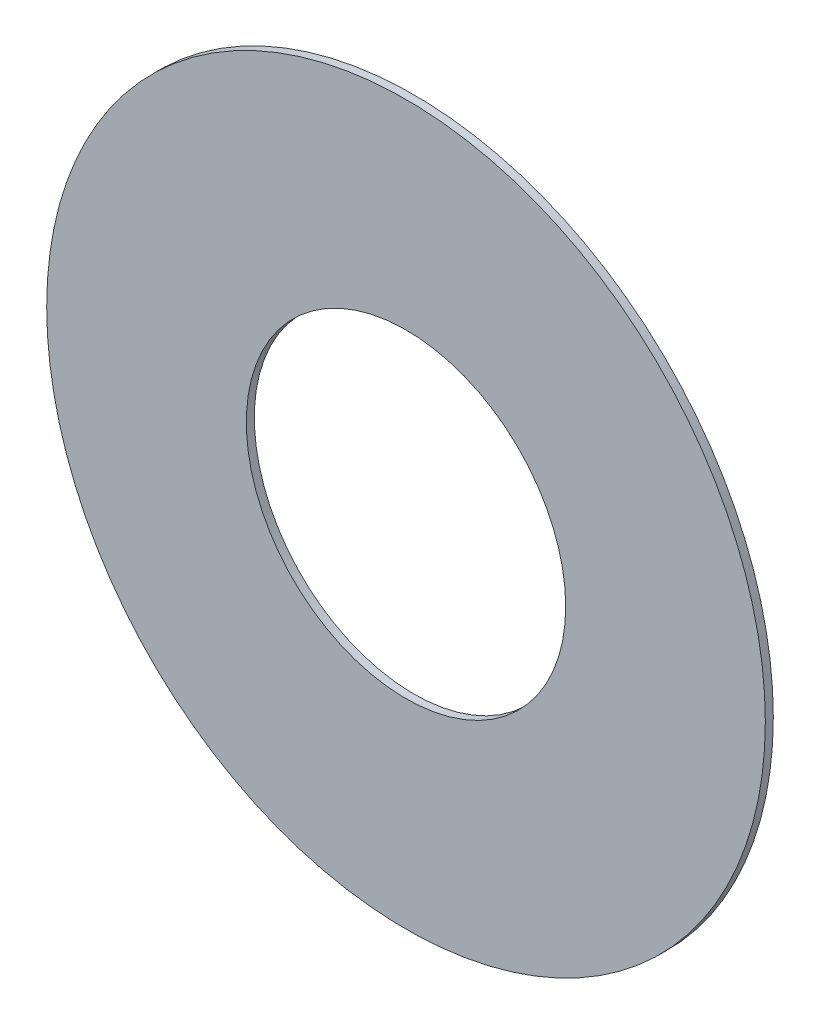
ISO-10303-21;
HEADER;
FILE_DESCRIPTION(('STEP AP214'),'2;1');
FILE_NAME('part.step','',(''),(''),'','','');
FILE_SCHEMA(('AUTOMOTIVE_DESIGN { 1 0 10303 214 1 1 1 1 }'));
ENDSEC;
DATA;
#1=APPLICATION_CONTEXT('core data for automotive mechanical design processes');
#2=APPLICATION_PROTOCOL_DEFINITION('international standard','automotive_design',2000,#1);
#3=PRODUCT_CONTEXT('',#1,'mechanical');
#4=PRODUCT('Part','Part','',(#3));
#5=PRODUCT_RELATED_PRODUCT_CATEGORY('part','',(#4));
#6=PRODUCT_DEFINITION_FORMATION('','',#4);
#7=PRODUCT_DEFINITION_CONTEXT('part definition',#1,'design');
#8=PRODUCT_DEFINITION('design','',#6,#7);
#9=PRODUCT_DEFINITION_SHAPE('','',#8);
#10=(LENGTH_UNIT() NAMED_UNIT(*) SI_UNIT(.MILLI.,.METRE.));
#11=(NAMED_UNIT(*) PLANE_ANGLE_UNIT() SI_UNIT($,.RADIAN.));
#12=(NAMED_UNIT(*) SI_UNIT($,.STERADIAN.) SOLID_ANGLE_UNIT());
#13=UNCERTAINTY_MEASURE_WITH_UNIT(LENGTH_MEASURE(1.E-05),#10,'distance_accuracy_value','');
#14=(GEOMETRIC_REPRESENTATION_CONTEXT(3) GLOBAL_UNCERTAINTY_ASSIGNED_CONTEXT((#13)) GLOBAL_UNIT_ASSIGNED_CONTEXT((#10,
#11,#12)) REPRESENTATION_CONTEXT('',''));
#15=CARTESIAN_POINT('',(0.,0.,0.));
#16=DIRECTION('',(0.,0.,1.));
#17=DIRECTION('',(1.,0.,0.));
#18=AXIS2_PLACEMENT_3D('',#15,#16,#17);
#19=CARTESIAN_POINT('',(0.,0.,0.2));
#20=DIRECTION('',(0.,0.,1.));
#21=DIRECTION('',(1.,0.,0.));
#22=AXIS2_PLACEMENT_3D('',#19,#20,#21);
#23=PLANE('',#22);
#24=CARTESIAN_POINT('',(0.,0.,0.2));
#25=DIRECTION('',(0.,0.,1.));
#26=DIRECTION('',(1.,0.,0.));
#27=AXIS2_PLACEMENT_3D('',#24,#25,#26);
#28=CIRCLE('',#27,9.);
#29=CARTESIAN_POINT('',(9.,0.,0.2));
#30=VERTEX_POINT('',#29);
#31=EDGE_CURVE('E10',#30,#30,#28,.T.);
#32=ORIENTED_EDGE('',*,*,#31,.T.);
#33=EDGE_LOOP('',(#32));
#34=FACE_BOUND('',#33,.T.);
#35=CARTESIAN_POINT('',(0.,0.,0.2));
#36=DIRECTION('',(0.,0.,1.));
#37=DIRECTION('',(1.,0.,0.));
#38=AXIS2_PLACEMENT_3D('',#35,#36,#37);
#39=CIRCLE('',#38,4.);
#40=CARTESIAN_POINT('',(4.,0.,0.2));
#41=VERTEX_POINT('',#40);
#42=EDGE_CURVE('E42',#41,#41,#39,.T.);
#43=ORIENTED_EDGE('',*,*,#42,.F.);
#44=EDGE_LOOP('',(#43));
#45=FACE_BOUND('',#44,.T.);
#46=ADVANCED_FACE('F31',(#34,#45),#23,.T.);
#47=CARTESIAN_POINT('',(0.,0.,0.));
#48=DIRECTION('',(0.,0.,1.));
#49=DIRECTION('',(1.,0.,0.));
#50=AXIS2_PLACEMENT_3D('',#47,#48,#49);
#51=PLANE('',#50);
#52=CARTESIAN_POINT('',(0.,0.,0.));
#53=DIRECTION('',(0.,0.,1.));
#54=DIRECTION('',(1.,0.,0.));
#55=AXIS2_PLACEMENT_3D('',#52,#53,#54);
#56=CIRCLE('',#55,9.);
#57=CARTESIAN_POINT('',(9.,0.,0.));
#58=VERTEX_POINT('',#57);
#59=EDGE_CURVE('E38',#58,#58,#56,.T.);
#60=ORIENTED_EDGE('',*,*,#59,.F.);
#61=EDGE_LOOP('',(#60));
#62=FACE_BOUND('',#61,.T.);
#63=CARTESIAN_POINT('',(0.,0.,0.));
#64=DIRECTION('',(0.,0.,1.));
#65=DIRECTION('',(1.,0.,0.));
#66=AXIS2_PLACEMENT_3D('',#63,#64,#65);
#67=CIRCLE('',#66,4.);
#68=CARTESIAN_POINT('',(4.,0.,0.));
#69=VERTEX_POINT('',#68);
#70=EDGE_CURVE('E46',#69,#69,#67,.T.);
#71=ORIENTED_EDGE('',*,*,#70,.T.);
#72=EDGE_LOOP('',(#71));
#73=FACE_BOUND('',#72,.T.);
#74=ADVANCED_FACE('F52',(#62,#73),#51,.F.);
#75=CARTESIAN_POINT('',(0.,0.,0.2));
#76=DIRECTION('',(0.,0.,-1.));
#77=DIRECTION('',(-1.,0.,0.));
#78=AXIS2_PLACEMENT_3D('',#75,#76,#77);
#79=CYLINDRICAL_SURFACE('',#78,9.);
#80=ORIENTED_EDGE('',*,*,#31,.F.);
#81=EDGE_LOOP('',(#80));
#82=FACE_BOUND('',#81,.T.);
#83=ORIENTED_EDGE('',*,*,#59,.T.);
#84=EDGE_LOOP('',(#83));
#85=FACE_BOUND('',#84,.T.);
#86=ADVANCED_FACE('F33',(#82,#85),#79,.T.);
#87=CARTESIAN_POINT('',(0.,0.,0.2));
#88=DIRECTION('',(0.,0.,-1.));
#89=DIRECTION('',(-1.,0.,0.));
#90=AXIS2_PLACEMENT_3D('',#87,#88,#89);
#91=CYLINDRICAL_SURFACE('',#90,4.);
#92=ORIENTED_EDGE('',*,*,#42,.T.);
#93=EDGE_LOOP('',(#92));
#94=FACE_BOUND('',#93,.T.);
#95=ORIENTED_EDGE('',*,*,#70,.F.);
#96=EDGE_LOOP('',(#95));
#97=FACE_BOUND('',#96,.T.);
#98=ADVANCED_FACE('F54',(#94,#97),#91,.F.);
#99=CLOSED_SHELL('',(#46,#74,#86,#98));
#100=MANIFOLD_SOLID_BREP('B2',#99);
#101=ADVANCED_BREP_SHAPE_REPRESENTATION('',(#18,#100),#14);
#102=SHAPE_DEFINITION_REPRESENTATION(#9,#101);
ENDSEC;
END-ISO-10303-21;
